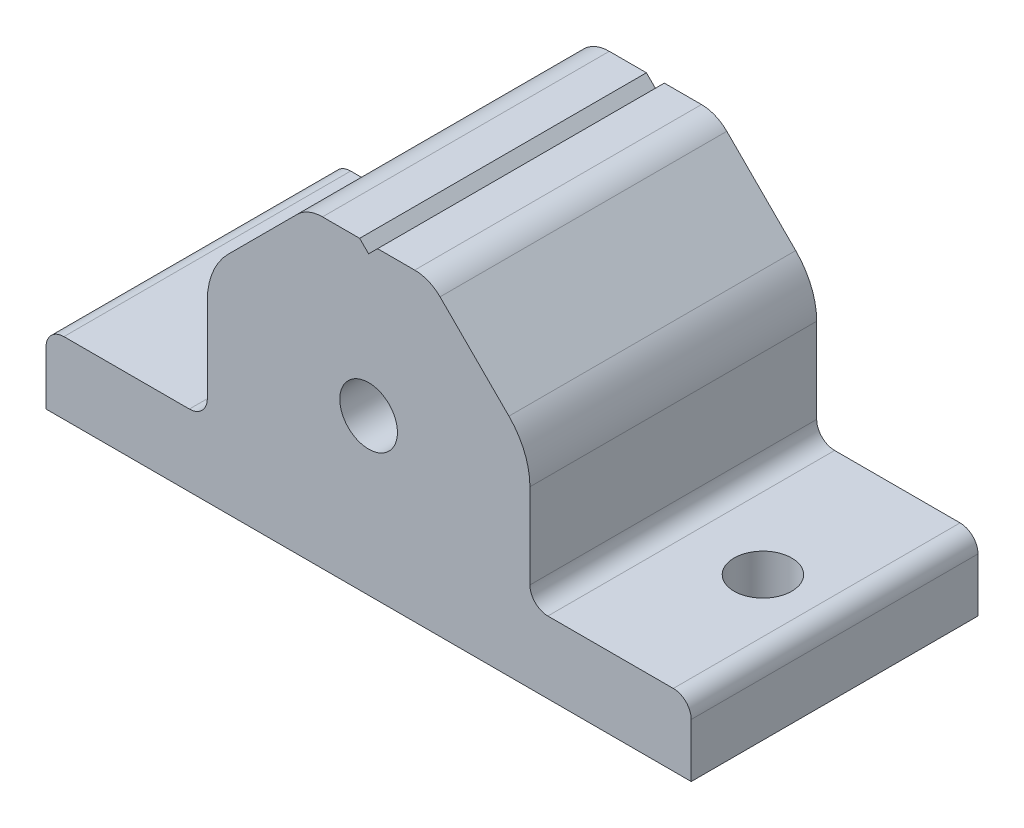
ISO-10303-21;
HEADER;
FILE_DESCRIPTION(('STEP AP214'),'2;1');
FILE_NAME('part.step','',(''),(''),'','','');
FILE_SCHEMA(('AUTOMOTIVE_DESIGN { 1 0 10303 214 1 1 1 1 }'));
ENDSEC;
DATA;
#1=APPLICATION_CONTEXT('core data for automotive mechanical design processes');
#2=APPLICATION_PROTOCOL_DEFINITION('international standard','automotive_design',2000,#1);
#3=PRODUCT_CONTEXT('',#1,'mechanical');
#4=PRODUCT('Part','Part','',(#3));
#5=PRODUCT_RELATED_PRODUCT_CATEGORY('part','',(#4));
#6=PRODUCT_DEFINITION_FORMATION('','',#4);
#7=PRODUCT_DEFINITION_CONTEXT('part definition',#1,'design');
#8=PRODUCT_DEFINITION('design','',#6,#7);
#9=PRODUCT_DEFINITION_SHAPE('','',#8);
#10=(LENGTH_UNIT() NAMED_UNIT(*) SI_UNIT(.MILLI.,.METRE.));
#11=(NAMED_UNIT(*) PLANE_ANGLE_UNIT() SI_UNIT($,.RADIAN.));
#12=(NAMED_UNIT(*) SI_UNIT($,.STERADIAN.) SOLID_ANGLE_UNIT());
#13=UNCERTAINTY_MEASURE_WITH_UNIT(LENGTH_MEASURE(1.E-05),#10,'distance_accuracy_value','');
#14=(GEOMETRIC_REPRESENTATION_CONTEXT(3) GLOBAL_UNCERTAINTY_ASSIGNED_CONTEXT((#13)) GLOBAL_UNIT_ASSIGNED_CONTEXT((#10,
#11,#12)) REPRESENTATION_CONTEXT('',''));
#15=CARTESIAN_POINT('',(0.,0.,0.));
#16=DIRECTION('',(0.,0.,1.));
#17=DIRECTION('',(1.,0.,0.));
#18=AXIS2_PLACEMENT_3D('',#15,#16,#17);
#19=CARTESIAN_POINT('',(0.793749999999984,26.9875,25.4));
#20=DIRECTION('',(-0.707106781186547,0.707106781186548,0.));
#21=DIRECTION('',(-0.707106781186548,-0.707106781186547,0.));
#22=AXIS2_PLACEMENT_3D('',#19,#20,#21);
#23=PLANE('',#22);
#24=DIRECTION('',(-0.707106781186548,-0.707106781186547,0.));
#25=VECTOR('',#24,1.);
#26=CARTESIAN_POINT('',(0.793749999999984,26.9875,25.4));
#27=LINE('',#26,#25);
#28=CARTESIAN_POINT('',(0.,26.19375,25.4));
#29=VERTEX_POINT('',#28);
#30=CARTESIAN_POINT('',(0.793749999999985,26.9875,25.4));
#31=VERTEX_POINT('',#30);
#32=EDGE_CURVE('E272',#29,#31,#27,.F.);
#33=ORIENTED_EDGE('',*,*,#32,.T.);
#34=DIRECTION('',(0.,0.,-1.));
#35=VECTOR('',#34,1.);
#36=CARTESIAN_POINT('',(0.793749999999985,26.9875,25.4));
#37=LINE('',#36,#35);
#38=CARTESIAN_POINT('',(0.793749999999984,26.9875,0.));
#39=VERTEX_POINT('',#38);
#40=EDGE_CURVE('E206',#31,#39,#37,.T.);
#41=ORIENTED_EDGE('',*,*,#40,.T.);
#42=DIRECTION('',(-0.707106781186548,-0.707106781186547,0.));
#43=VECTOR('',#42,1.);
#44=CARTESIAN_POINT('',(0.793749999999984,26.9875,0.));
#45=LINE('',#44,#43);
#46=CARTESIAN_POINT('',(0.,26.19375,0.));
#47=VERTEX_POINT('',#46);
#48=EDGE_CURVE('E279',#39,#47,#45,.T.);
#49=ORIENTED_EDGE('',*,*,#48,.T.);
#50=DIRECTION('',(0.,0.,1.));
#51=VECTOR('',#50,1.);
#52=CARTESIAN_POINT('',(0.,26.19375,25.4));
#53=LINE('',#52,#51);
#54=EDGE_CURVE('E259',#29,#47,#53,.F.);
#55=ORIENTED_EDGE('',*,*,#54,.F.);
#56=EDGE_LOOP('',(#33,#41,#49,#55));
#57=FACE_BOUND('',#56,.T.);
#58=ADVANCED_FACE('F18',(#57),#23,.T.);
#59=CARTESIAN_POINT('',(0.,26.19375,25.4));
#60=DIRECTION('',(0.707106781186547,0.707106781186548,0.));
#61=DIRECTION('',(-0.707106781186548,0.707106781186547,0.));
#62=AXIS2_PLACEMENT_3D('',#59,#60,#61);
#63=PLANE('',#62);
#64=DIRECTION('',(-0.707106781186548,0.707106781186547,0.));
#65=VECTOR('',#64,1.);
#66=CARTESIAN_POINT('',(0.,26.19375,25.4));
#67=LINE('',#66,#65);
#68=CARTESIAN_POINT('',(-0.793750000000016,26.9875,25.4));
#69=VERTEX_POINT('',#68);
#70=EDGE_CURVE('E271',#69,#29,#67,.F.);
#71=ORIENTED_EDGE('',*,*,#70,.T.);
#72=ORIENTED_EDGE('',*,*,#54,.T.);
#73=DIRECTION('',(-0.707106781186548,0.707106781186547,0.));
#74=VECTOR('',#73,1.);
#75=CARTESIAN_POINT('',(0.,26.19375,0.));
#76=LINE('',#75,#74);
#77=CARTESIAN_POINT('',(-0.793750000000016,26.9875,0.));
#78=VERTEX_POINT('',#77);
#79=EDGE_CURVE('E269',#47,#78,#76,.T.);
#80=ORIENTED_EDGE('',*,*,#79,.T.);
#81=DIRECTION('',(0.,0.,-1.));
#82=VECTOR('',#81,1.);
#83=CARTESIAN_POINT('',(-0.793750000000017,26.9875,25.4));
#84=LINE('',#83,#82);
#85=EDGE_CURVE('E198',#78,#69,#84,.F.);
#86=ORIENTED_EDGE('',*,*,#85,.T.);
#87=EDGE_LOOP('',(#71,#72,#80,#86));
#88=FACE_BOUND('',#87,.T.);
#89=ADVANCED_FACE('F486',(#88),#63,.T.);
#90=CARTESIAN_POINT('',(0.,13.7668,0.));
#91=DIRECTION('',(0.,0.,1.));
#92=DIRECTION('',(1.,0.,0.));
#93=AXIS2_PLACEMENT_3D('',#90,#91,#92);
#94=CYLINDRICAL_SURFACE('',#93,2.5527);
#95=CARTESIAN_POINT('',(0.,13.7668,0.));
#96=DIRECTION('',(0.,0.,1.));
#97=DIRECTION('',(1.,0.,0.));
#98=AXIS2_PLACEMENT_3D('',#95,#96,#97);
#99=CIRCLE('',#98,2.5527);
#100=CARTESIAN_POINT('',(2.55269999999999,13.7668,0.));
#101=VERTEX_POINT('',#100);
#102=EDGE_CURVE('E229',#101,#101,#99,.F.);
#103=ORIENTED_EDGE('',*,*,#102,.T.);
#104=EDGE_LOOP('',(#103));
#105=FACE_BOUND('',#104,.T.);
#106=CARTESIAN_POINT('',(0.,13.7668,25.4));
#107=DIRECTION('',(0.,0.,1.));
#108=DIRECTION('',(1.,0.,0.));
#109=AXIS2_PLACEMENT_3D('',#106,#107,#108);
#110=CIRCLE('',#109,2.5527);
#111=CARTESIAN_POINT('',(2.55269999999999,13.7668,25.4));
#112=VERTEX_POINT('',#111);
#113=EDGE_CURVE('E192',#112,#112,#110,.F.);
#114=ORIENTED_EDGE('',*,*,#113,.F.);
#115=EDGE_LOOP('',(#114));
#116=FACE_BOUND('',#115,.T.);
#117=ADVANCED_FACE('F523',(#105,#116),#94,.F.);
#118=CARTESIAN_POINT('',(-7.93749999999999,15.4672438789308,0.));
#119=DIRECTION('',(0.,0.,-1.));
#120=DIRECTION('',(-1.,0.,0.));
#121=AXIS2_PLACEMENT_3D('',#118,#119,#120);
#122=CYLINDRICAL_SURFACE('',#121,6.35);
#123=CARTESIAN_POINT('',(-7.93749999999999,15.4672438789308,0.));
#124=DIRECTION('',(0.,0.,-1.));
#125=DIRECTION('',(-1.,0.,0.));
#126=AXIS2_PLACEMENT_3D('',#123,#124,#125);
#127=CIRCLE('',#126,6.35);
#128=CARTESIAN_POINT('',(-12.4276280605346,19.9573719394654,0.));
#129=VERTEX_POINT('',#128);
#130=CARTESIAN_POINT('',(-14.2875,15.4672438789308,0.));
#131=VERTEX_POINT('',#130);
#132=EDGE_CURVE('E322',#129,#131,#127,.F.);
#133=ORIENTED_EDGE('',*,*,#132,.T.);
#134=DIRECTION('',(0.,0.,1.));
#135=VECTOR('',#134,1.);
#136=CARTESIAN_POINT('',(-14.2875,15.4672438789308,0.));
#137=LINE('',#136,#135);
#138=CARTESIAN_POINT('',(-14.2875,15.4672438789308,25.4));
#139=VERTEX_POINT('',#138);
#140=EDGE_CURVE('E256',#131,#139,#137,.T.);
#141=ORIENTED_EDGE('',*,*,#140,.T.);
#142=CARTESIAN_POINT('',(-7.93749999999999,15.4672438789308,25.4));
#143=DIRECTION('',(0.,0.,-1.));
#144=DIRECTION('',(-1.,0.,0.));
#145=AXIS2_PLACEMENT_3D('',#142,#143,#144);
#146=CIRCLE('',#145,6.35);
#147=CARTESIAN_POINT('',(-12.4276280605346,19.9573719394654,25.4));
#148=VERTEX_POINT('',#147);
#149=EDGE_CURVE('E184',#148,#139,#146,.F.);
#150=ORIENTED_EDGE('',*,*,#149,.F.);
#151=DIRECTION('',(0.,0.,1.));
#152=VECTOR('',#151,1.);
#153=CARTESIAN_POINT('',(-12.4276280605346,19.9573719394654,25.4));
#154=LINE('',#153,#152);
#155=EDGE_CURVE('E180',#148,#129,#154,.F.);
#156=ORIENTED_EDGE('',*,*,#155,.T.);
#157=EDGE_LOOP('',(#133,#141,#150,#156));
#158=FACE_BOUND('',#157,.T.);
#159=ADVANCED_FACE('F427',(#158),#122,.T.);
#160=CARTESIAN_POINT('',(-14.2875,26.9875,0.));
#161=DIRECTION('',(1.,0.,0.));
#162=DIRECTION('',(0.,1.,0.));
#163=AXIS2_PLACEMENT_3D('',#160,#161,#162);
#164=PLANE('',#163);
#165=ORIENTED_EDGE('',*,*,#140,.F.);
#166=DIRECTION('',(0.,1.,0.));
#167=VECTOR('',#166,1.);
#168=CARTESIAN_POINT('',(-14.2875,0.,0.));
#169=LINE('',#168,#167);
#170=CARTESIAN_POINT('',(-14.2875,7.9375,0.));
#171=VERTEX_POINT('',#170);
#172=EDGE_CURVE('E321',#131,#171,#169,.F.);
#173=ORIENTED_EDGE('',*,*,#172,.T.);
#174=DIRECTION('',(0.,0.,-1.));
#175=VECTOR('',#174,1.);
#176=CARTESIAN_POINT('',(-14.2875,7.9375,0.));
#177=LINE('',#176,#175);
#178=CARTESIAN_POINT('',(-14.2875,7.9375,25.4));
#179=VERTEX_POINT('',#178);
#180=EDGE_CURVE('E253',#171,#179,#177,.F.);
#181=ORIENTED_EDGE('',*,*,#180,.T.);
#182=DIRECTION('',(0.,1.,0.));
#183=VECTOR('',#182,1.);
#184=CARTESIAN_POINT('',(-14.2875,0.,25.4));
#185=LINE('',#184,#183);
#186=EDGE_CURVE('E186',#139,#179,#185,.F.);
#187=ORIENTED_EDGE('',*,*,#186,.F.);
#188=EDGE_LOOP('',(#165,#173,#181,#187));
#189=FACE_BOUND('',#188,.T.);
#190=ADVANCED_FACE('F425',(#189),#164,.F.);
#191=CARTESIAN_POINT('',(-15.875,7.9375,0.));
#192=DIRECTION('',(0.,0.,-1.));
#193=DIRECTION('',(-1.,0.,0.));
#194=AXIS2_PLACEMENT_3D('',#191,#192,#193);
#195=CYLINDRICAL_SURFACE('',#194,1.5875);
#196=DIRECTION('',(0.,0.,1.));
#197=VECTOR('',#196,1.);
#198=CARTESIAN_POINT('',(-15.875,6.35,0.));
#199=LINE('',#198,#197);
#200=CARTESIAN_POINT('',(-15.875,6.35,0.));
#201=VERTEX_POINT('',#200);
#202=CARTESIAN_POINT('',(-15.875,6.35,25.4));
#203=VERTEX_POINT('',#202);
#204=EDGE_CURVE('E250',#201,#203,#199,.T.);
#205=ORIENTED_EDGE('',*,*,#204,.T.);
#206=CARTESIAN_POINT('',(-15.875,7.9375,25.4));
#207=DIRECTION('',(0.,0.,-1.));
#208=DIRECTION('',(-1.,0.,0.));
#209=AXIS2_PLACEMENT_3D('',#206,#207,#208);
#210=CIRCLE('',#209,1.5875);
#211=EDGE_CURVE('E342',#179,#203,#210,.T.);
#212=ORIENTED_EDGE('',*,*,#211,.F.);
#213=ORIENTED_EDGE('',*,*,#180,.F.);
#214=CARTESIAN_POINT('',(-15.875,7.9375,0.));
#215=DIRECTION('',(0.,0.,-1.));
#216=DIRECTION('',(-1.,0.,0.));
#217=AXIS2_PLACEMENT_3D('',#214,#215,#216);
#218=CIRCLE('',#217,1.5875);
#219=EDGE_CURVE('E318',#171,#201,#218,.T.);
#220=ORIENTED_EDGE('',*,*,#219,.T.);
#221=EDGE_LOOP('',(#205,#212,#213,#220));
#222=FACE_BOUND('',#221,.T.);
#223=ADVANCED_FACE('F422',(#222),#195,.F.);
#224=CARTESIAN_POINT('',(-28.575,6.35,0.));
#225=DIRECTION('',(0.,-1.,0.));
#226=DIRECTION('',(1.,0.,0.));
#227=AXIS2_PLACEMENT_3D('',#224,#225,#226);
#228=PLANE('',#227);
#229=DIRECTION('',(0.,0.,1.));
#230=VECTOR('',#229,1.);
#231=CARTESIAN_POINT('',(-26.9875,6.35,0.));
#232=LINE('',#231,#230);
#233=CARTESIAN_POINT('',(-26.9875,6.35,25.4));
#234=VERTEX_POINT('',#233);
#235=CARTESIAN_POINT('',(-26.9875,6.35,0.));
#236=VERTEX_POINT('',#235);
#237=EDGE_CURVE('E227',#234,#236,#232,.F.);
#238=ORIENTED_EDGE('',*,*,#237,.F.);
#239=DIRECTION('',(1.,0.,0.));
#240=VECTOR('',#239,1.);
#241=CARTESIAN_POINT('',(0.,6.35,25.4));
#242=LINE('',#241,#240);
#243=EDGE_CURVE('E341',#203,#234,#242,.F.);
#244=ORIENTED_EDGE('',*,*,#243,.F.);
#245=ORIENTED_EDGE('',*,*,#204,.F.);
#246=DIRECTION('',(1.,0.,0.));
#247=VECTOR('',#246,1.);
#248=CARTESIAN_POINT('',(0.,6.35,0.));
#249=LINE('',#248,#247);
#250=EDGE_CURVE('E317',#201,#236,#249,.F.);
#251=ORIENTED_EDGE('',*,*,#250,.T.);
#252=EDGE_LOOP('',(#238,#244,#245,#251));
#253=FACE_BOUND('',#252,.T.);
#254=CARTESIAN_POINT('',(-22.225,6.34999999999999,12.7));
#255=DIRECTION('',(0.,1.,0.));
#256=DIRECTION('',(-1.,0.,0.));
#257=AXIS2_PLACEMENT_3D('',#254,#255,#256);
#258=CIRCLE('',#257,2.5527);
#259=CARTESIAN_POINT('',(-24.7777,6.34999999999999,12.7));
#260=VERTEX_POINT('',#259);
#261=EDGE_CURVE('E21',#260,#260,#258,.F.);
#262=ORIENTED_EDGE('',*,*,#261,.T.);
#263=EDGE_LOOP('',(#262));
#264=FACE_BOUND('',#263,.T.);
#265=ADVANCED_FACE('F351',(#253,#264),#228,.F.);
#266=CARTESIAN_POINT('',(-26.9875,4.7625,0.));
#267=DIRECTION('',(0.,0.,1.));
#268=DIRECTION('',(1.,0.,0.));
#269=AXIS2_PLACEMENT_3D('',#266,#267,#268);
#270=CYLINDRICAL_SURFACE('',#269,1.5875);
#271=CARTESIAN_POINT('',(-26.9875,4.7625,25.4));
#272=DIRECTION('',(0.,0.,1.));
#273=DIRECTION('',(1.,0.,0.));
#274=AXIS2_PLACEMENT_3D('',#271,#272,#273);
#275=CIRCLE('',#274,1.5875);
#276=CARTESIAN_POINT('',(-28.575,4.7625,25.4));
#277=VERTEX_POINT('',#276);
#278=EDGE_CURVE('E339',#234,#277,#275,.T.);
#279=ORIENTED_EDGE('',*,*,#278,.F.);
#280=ORIENTED_EDGE('',*,*,#237,.T.);
#281=CARTESIAN_POINT('',(-26.9875,4.7625,0.));
#282=DIRECTION('',(0.,0.,1.));
#283=DIRECTION('',(1.,0.,0.));
#284=AXIS2_PLACEMENT_3D('',#281,#282,#283);
#285=CIRCLE('',#284,1.5875);
#286=CARTESIAN_POINT('',(-28.575,4.7625,0.));
#287=VERTEX_POINT('',#286);
#288=EDGE_CURVE('E313',#236,#287,#285,.T.);
#289=ORIENTED_EDGE('',*,*,#288,.T.);
#290=DIRECTION('',(0.,0.,1.));
#291=VECTOR('',#290,1.);
#292=CARTESIAN_POINT('',(-28.575,4.7625,25.4));
#293=LINE('',#292,#291);
#294=EDGE_CURVE('E239',#287,#277,#293,.T.);
#295=ORIENTED_EDGE('',*,*,#294,.T.);
#296=EDGE_LOOP('',(#279,#280,#289,#295));
#297=FACE_BOUND('',#296,.T.);
#298=ADVANCED_FACE('F399',(#297),#270,.T.);
#299=CARTESIAN_POINT('',(26.9875,4.7625,25.4));
#300=DIRECTION('',(0.,0.,1.));
#301=DIRECTION('',(1.,0.,0.));
#302=AXIS2_PLACEMENT_3D('',#299,#300,#301);
#303=CYLINDRICAL_SURFACE('',#302,1.5875);
#304=CARTESIAN_POINT('',(26.9875,4.7625,25.4));
#305=DIRECTION('',(0.,0.,1.));
#306=DIRECTION('',(1.,0.,0.));
#307=AXIS2_PLACEMENT_3D('',#304,#305,#306);
#308=CIRCLE('',#307,1.5875);
#309=CARTESIAN_POINT('',(28.575,4.7625,25.4));
#310=VERTEX_POINT('',#309);
#311=CARTESIAN_POINT('',(26.9875,6.35,25.4));
#312=VERTEX_POINT('',#311);
#313=EDGE_CURVE('E336',#310,#312,#308,.T.);
#314=ORIENTED_EDGE('',*,*,#313,.F.);
#315=DIRECTION('',(0.,0.,1.));
#316=VECTOR('',#315,1.);
#317=CARTESIAN_POINT('',(28.575,4.7625,25.4));
#318=LINE('',#317,#316);
#319=CARTESIAN_POINT('',(28.575,4.7625,0.));
#320=VERTEX_POINT('',#319);
#321=EDGE_CURVE('E228',#310,#320,#318,.F.);
#322=ORIENTED_EDGE('',*,*,#321,.T.);
#323=CARTESIAN_POINT('',(26.9875,4.7625,0.));
#324=DIRECTION('',(0.,0.,1.));
#325=DIRECTION('',(1.,0.,0.));
#326=AXIS2_PLACEMENT_3D('',#323,#324,#325);
#327=CIRCLE('',#326,1.5875);
#328=CARTESIAN_POINT('',(26.9875,6.35,0.));
#329=VERTEX_POINT('',#328);
#330=EDGE_CURVE('E310',#320,#329,#327,.T.);
#331=ORIENTED_EDGE('',*,*,#330,.T.);
#332=DIRECTION('',(0.,0.,1.));
#333=VECTOR('',#332,1.);
#334=CARTESIAN_POINT('',(26.9875,6.35,0.));
#335=LINE('',#334,#333);
#336=EDGE_CURVE('E224',#329,#312,#335,.T.);
#337=ORIENTED_EDGE('',*,*,#336,.T.);
#338=EDGE_LOOP('',(#314,#322,#331,#337));
#339=FACE_BOUND('',#338,.T.);
#340=ADVANCED_FACE('F451',(#339),#303,.T.);
#341=CARTESIAN_POINT('',(28.575,6.35,0.));
#342=DIRECTION('',(0.,-1.,0.));
#343=DIRECTION('',(1.,0.,0.));
#344=AXIS2_PLACEMENT_3D('',#341,#342,#343);
#345=PLANE('',#344);
#346=ORIENTED_EDGE('',*,*,#336,.F.);
#347=DIRECTION('',(1.,0.,0.));
#348=VECTOR('',#347,1.);
#349=CARTESIAN_POINT('',(0.,6.35,0.));
#350=LINE('',#349,#348);
#351=CARTESIAN_POINT('',(15.875,6.35,0.));
#352=VERTEX_POINT('',#351);
#353=EDGE_CURVE('E309',#329,#352,#350,.F.);
#354=ORIENTED_EDGE('',*,*,#353,.T.);
#355=DIRECTION('',(0.,0.,-1.));
#356=VECTOR('',#355,1.);
#357=CARTESIAN_POINT('',(15.875,6.35,0.));
#358=LINE('',#357,#356);
#359=CARTESIAN_POINT('',(15.875,6.35,25.4));
#360=VERTEX_POINT('',#359);
#361=EDGE_CURVE('E221',#352,#360,#358,.F.);
#362=ORIENTED_EDGE('',*,*,#361,.T.);
#363=DIRECTION('',(1.,0.,0.));
#364=VECTOR('',#363,1.);
#365=CARTESIAN_POINT('',(0.,6.35,25.4));
#366=LINE('',#365,#364);
#367=EDGE_CURVE('E335',#312,#360,#366,.F.);
#368=ORIENTED_EDGE('',*,*,#367,.F.);
#369=EDGE_LOOP('',(#346,#354,#362,#368));
#370=FACE_BOUND('',#369,.T.);
#371=CARTESIAN_POINT('',(22.225,6.35,12.7));
#372=DIRECTION('',(0.,1.,0.));
#373=DIRECTION('',(-1.,0.,0.));
#374=AXIS2_PLACEMENT_3D('',#371,#372,#373);
#375=CIRCLE('',#374,2.5527);
#376=CARTESIAN_POINT('',(19.6723,6.35,12.7));
#377=VERTEX_POINT('',#376);
#378=EDGE_CURVE('E242',#377,#377,#375,.F.);
#379=ORIENTED_EDGE('',*,*,#378,.T.);
#380=EDGE_LOOP('',(#379));
#381=FACE_BOUND('',#380,.T.);
#382=ADVANCED_FACE('F454',(#370,#381),#345,.F.);
#383=CARTESIAN_POINT('',(15.875,7.9375,0.));
#384=DIRECTION('',(0.,0.,-1.));
#385=DIRECTION('',(-1.,0.,0.));
#386=AXIS2_PLACEMENT_3D('',#383,#384,#385);
#387=CYLINDRICAL_SURFACE('',#386,1.5875);
#388=DIRECTION('',(0.,0.,1.));
#389=VECTOR('',#388,1.);
#390=CARTESIAN_POINT('',(14.2875,7.9375,0.));
#391=LINE('',#390,#389);
#392=CARTESIAN_POINT('',(14.2875,7.9375,0.));
#393=VERTEX_POINT('',#392);
#394=CARTESIAN_POINT('',(14.2875,7.9375,25.4));
#395=VERTEX_POINT('',#394);
#396=EDGE_CURVE('E218',#393,#395,#391,.T.);
#397=ORIENTED_EDGE('',*,*,#396,.T.);
#398=CARTESIAN_POINT('',(15.875,7.9375,25.4));
#399=DIRECTION('',(0.,0.,-1.));
#400=DIRECTION('',(-1.,0.,0.));
#401=AXIS2_PLACEMENT_3D('',#398,#399,#400);
#402=CIRCLE('',#401,1.5875);
#403=EDGE_CURVE('E333',#360,#395,#402,.T.);
#404=ORIENTED_EDGE('',*,*,#403,.F.);
#405=ORIENTED_EDGE('',*,*,#361,.F.);
#406=CARTESIAN_POINT('',(15.875,7.9375,0.));
#407=DIRECTION('',(0.,0.,-1.));
#408=DIRECTION('',(-1.,0.,0.));
#409=AXIS2_PLACEMENT_3D('',#406,#407,#408);
#410=CIRCLE('',#409,1.5875);
#411=EDGE_CURVE('E306',#352,#393,#410,.T.);
#412=ORIENTED_EDGE('',*,*,#411,.T.);
#413=EDGE_LOOP('',(#397,#404,#405,#412));
#414=FACE_BOUND('',#413,.T.);
#415=ADVANCED_FACE('F458',(#414),#387,.F.);
#416=CARTESIAN_POINT('',(14.2875,26.9875,0.));
#417=DIRECTION('',(-1.,0.,0.));
#418=DIRECTION('',(0.,-1.,0.));
#419=AXIS2_PLACEMENT_3D('',#416,#417,#418);
#420=PLANE('',#419);
#421=DIRECTION('',(0.,0.,1.));
#422=VECTOR('',#421,1.);
#423=CARTESIAN_POINT('',(14.2875,15.4672438789308,0.));
#424=LINE('',#423,#422);
#425=CARTESIAN_POINT('',(14.2875,15.4672438789308,25.4));
#426=VERTEX_POINT('',#425);
#427=CARTESIAN_POINT('',(14.2875,15.4672438789308,0.));
#428=VERTEX_POINT('',#427);
#429=EDGE_CURVE('E216',#426,#428,#424,.F.);
#430=ORIENTED_EDGE('',*,*,#429,.F.);
#431=DIRECTION('',(0.,1.,0.));
#432=VECTOR('',#431,1.);
#433=CARTESIAN_POINT('',(14.2875,0.,25.4));
#434=LINE('',#433,#432);
#435=EDGE_CURVE('E332',#395,#426,#434,.T.);
#436=ORIENTED_EDGE('',*,*,#435,.F.);
#437=ORIENTED_EDGE('',*,*,#396,.F.);
#438=DIRECTION('',(0.,1.,0.));
#439=VECTOR('',#438,1.);
#440=CARTESIAN_POINT('',(14.2875,0.,0.));
#441=LINE('',#440,#439);
#442=EDGE_CURVE('E305',#393,#428,#441,.T.);
#443=ORIENTED_EDGE('',*,*,#442,.T.);
#444=EDGE_LOOP('',(#430,#436,#437,#443));
#445=FACE_BOUND('',#444,.T.);
#446=ADVANCED_FACE('F463',(#445),#420,.F.);
#447=CARTESIAN_POINT('',(7.9375,15.4672438789308,0.));
#448=DIRECTION('',(0.,0.,1.));
#449=DIRECTION('',(1.,0.,0.));
#450=AXIS2_PLACEMENT_3D('',#447,#448,#449);
#451=CYLINDRICAL_SURFACE('',#450,6.35);
#452=CARTESIAN_POINT('',(7.9375,15.4672438789308,25.4));
#453=DIRECTION('',(0.,0.,1.));
#454=DIRECTION('',(1.,0.,0.));
#455=AXIS2_PLACEMENT_3D('',#452,#453,#454);
#456=CIRCLE('',#455,6.35);
#457=CARTESIAN_POINT('',(12.4276280605346,19.9573719394654,25.4));
#458=VERTEX_POINT('',#457);
#459=EDGE_CURVE('E330',#426,#458,#456,.T.);
#460=ORIENTED_EDGE('',*,*,#459,.F.);
#461=ORIENTED_EDGE('',*,*,#429,.T.);
#462=CARTESIAN_POINT('',(7.9375,15.4672438789308,0.));
#463=DIRECTION('',(0.,0.,1.));
#464=DIRECTION('',(1.,0.,0.));
#465=AXIS2_PLACEMENT_3D('',#462,#463,#464);
#466=CIRCLE('',#465,6.35);
#467=CARTESIAN_POINT('',(12.4276280605346,19.9573719394654,0.));
#468=VERTEX_POINT('',#467);
#469=EDGE_CURVE('E302',#428,#468,#466,.T.);
#470=ORIENTED_EDGE('',*,*,#469,.T.);
#471=DIRECTION('',(0.,0.,1.));
#472=VECTOR('',#471,1.);
#473=CARTESIAN_POINT('',(12.4276280605346,19.9573719394654,0.));
#474=LINE('',#473,#472);
#475=EDGE_CURVE('E213',#468,#458,#474,.T.);
#476=ORIENTED_EDGE('',*,*,#475,.T.);
#477=EDGE_LOOP('',(#460,#461,#470,#476));
#478=FACE_BOUND('',#477,.T.);
#479=ADVANCED_FACE('F467',(#478),#451,.T.);
#480=CARTESIAN_POINT('',(14.2875,18.0975,0.));
#481=DIRECTION('',(-0.707106781186546,-0.707106781186549,0.));
#482=DIRECTION('',(0.707106781186549,-0.707106781186546,0.));
#483=AXIS2_PLACEMENT_3D('',#480,#481,#482);
#484=PLANE('',#483);
#485=DIRECTION('',(0.,0.,-1.));
#486=VECTOR('',#485,1.);
#487=CARTESIAN_POINT('',(6.32743596973268,26.0575640302673,25.4));
#488=LINE('',#487,#486);
#489=CARTESIAN_POINT('',(6.32743596973268,26.0575640302673,25.4));
#490=VERTEX_POINT('',#489);
#491=CARTESIAN_POINT('',(6.32743596973268,26.0575640302673,0.));
#492=VERTEX_POINT('',#491);
#493=EDGE_CURVE('E209',#490,#492,#488,.T.);
#494=ORIENTED_EDGE('',*,*,#493,.F.);
#495=DIRECTION('',(-0.707106781186549,0.707106781186547,0.));
#496=VECTOR('',#495,1.);
#497=CARTESIAN_POINT('',(12.4276280605346,19.9573719394654,25.4));
#498=LINE('',#497,#496);
#499=EDGE_CURVE('E329',#458,#490,#498,.T.);
#500=ORIENTED_EDGE('',*,*,#499,.F.);
#501=ORIENTED_EDGE('',*,*,#475,.F.);
#502=DIRECTION('',(-0.707106781186549,0.707106781186547,0.));
#503=VECTOR('',#502,1.);
#504=CARTESIAN_POINT('',(12.4276280605346,19.9573719394654,0.));
#505=LINE('',#504,#503);
#506=EDGE_CURVE('E301',#468,#492,#505,.T.);
#507=ORIENTED_EDGE('',*,*,#506,.T.);
#508=EDGE_LOOP('',(#494,#500,#501,#507));
#509=FACE_BOUND('',#508,.T.);
#510=ADVANCED_FACE('F472',(#509),#484,.F.);
#511=CARTESIAN_POINT('',(4.0823719394654,23.8125,25.4));
#512=DIRECTION('',(0.,0.,-1.));
#513=DIRECTION('',(-1.,0.,0.));
#514=AXIS2_PLACEMENT_3D('',#511,#512,#513);
#515=CYLINDRICAL_SURFACE('',#514,3.175);
#516=CARTESIAN_POINT('',(4.0823719394654,23.8125,0.));
#517=DIRECTION('',(0.,0.,-1.));
#518=DIRECTION('',(-1.,0.,0.));
#519=AXIS2_PLACEMENT_3D('',#516,#517,#518);
#520=CIRCLE('',#519,3.175);
#521=CARTESIAN_POINT('',(4.08237193946539,26.9875,0.));
#522=VERTEX_POINT('',#521);
#523=EDGE_CURVE('E297',#492,#522,#520,.F.);
#524=ORIENTED_EDGE('',*,*,#523,.T.);
#525=DIRECTION('',(0.,0.,-1.));
#526=VECTOR('',#525,1.);
#527=CARTESIAN_POINT('',(4.08237193946539,26.9875,25.4));
#528=LINE('',#527,#526);
#529=CARTESIAN_POINT('',(4.08237193946539,26.9875,25.4));
#530=VERTEX_POINT('',#529);
#531=EDGE_CURVE('E201',#522,#530,#528,.F.);
#532=ORIENTED_EDGE('',*,*,#531,.T.);
#533=CARTESIAN_POINT('',(4.0823719394654,23.8125,25.4));
#534=DIRECTION('',(0.,0.,-1.));
#535=DIRECTION('',(-1.,0.,0.));
#536=AXIS2_PLACEMENT_3D('',#533,#534,#535);
#537=CIRCLE('',#536,3.175);
#538=EDGE_CURVE('E327',#490,#530,#537,.F.);
#539=ORIENTED_EDGE('',*,*,#538,.F.);
#540=ORIENTED_EDGE('',*,*,#493,.T.);
#541=EDGE_LOOP('',(#524,#532,#539,#540));
#542=FACE_BOUND('',#541,.T.);
#543=ADVANCED_FACE('F476',(#542),#515,.T.);
#544=CARTESIAN_POINT('',(-28.575,26.9875,25.4));
#545=DIRECTION('',(0.,-1.,0.));
#546=DIRECTION('',(0.,0.,-1.));
#547=AXIS2_PLACEMENT_3D('',#544,#545,#546);
#548=PLANE('',#547);
#549=ORIENTED_EDGE('',*,*,#531,.F.);
#550=DIRECTION('',(1.,0.,0.));
#551=VECTOR('',#550,1.);
#552=CARTESIAN_POINT('',(0.,26.9875,0.));
#553=LINE('',#552,#551);
#554=EDGE_CURVE('E300',#522,#39,#553,.F.);
#555=ORIENTED_EDGE('',*,*,#554,.T.);
#556=ORIENTED_EDGE('',*,*,#40,.F.);
#557=DIRECTION('',(1.,0.,0.));
#558=VECTOR('',#557,1.);
#559=CARTESIAN_POINT('',(0.,26.9875,25.4));
#560=LINE('',#559,#558);
#561=EDGE_CURVE('E262',#530,#31,#560,.F.);
#562=ORIENTED_EDGE('',*,*,#561,.F.);
#563=EDGE_LOOP('',(#549,#555,#556,#562));
#564=FACE_BOUND('',#563,.T.);
#565=ADVANCED_FACE('F481',(#564),#548,.F.);
#566=CARTESIAN_POINT('',(-28.575,26.9875,25.4));
#567=DIRECTION('',(0.,-1.,0.));
#568=DIRECTION('',(0.,0.,-1.));
#569=AXIS2_PLACEMENT_3D('',#566,#567,#568);
#570=PLANE('',#569);
#571=DIRECTION('',(0.,0.,1.));
#572=VECTOR('',#571,1.);
#573=CARTESIAN_POINT('',(-4.0823719394654,26.9875,25.4));
#574=LINE('',#573,#572);
#575=CARTESIAN_POINT('',(-4.0823719394654,26.9875,25.4));
#576=VERTEX_POINT('',#575);
#577=CARTESIAN_POINT('',(-4.0823719394654,26.9875,0.));
#578=VERTEX_POINT('',#577);
#579=EDGE_CURVE('E196',#576,#578,#574,.F.);
#580=ORIENTED_EDGE('',*,*,#579,.F.);
#581=DIRECTION('',(1.,0.,0.));
#582=VECTOR('',#581,1.);
#583=CARTESIAN_POINT('',(0.,26.9875,25.4));
#584=LINE('',#583,#582);
#585=EDGE_CURVE('E158',#69,#576,#584,.F.);
#586=ORIENTED_EDGE('',*,*,#585,.F.);
#587=ORIENTED_EDGE('',*,*,#85,.F.);
#588=DIRECTION('',(1.,0.,0.));
#589=VECTOR('',#588,1.);
#590=CARTESIAN_POINT('',(0.,26.9875,0.));
#591=LINE('',#590,#589);
#592=EDGE_CURVE('E296',#78,#578,#591,.F.);
#593=ORIENTED_EDGE('',*,*,#592,.T.);
#594=EDGE_LOOP('',(#580,#586,#587,#593));
#595=FACE_BOUND('',#594,.T.);
#596=ADVANCED_FACE('F489',(#595),#570,.F.);
#597=CARTESIAN_POINT('',(-4.0823719394654,23.8125,25.4));
#598=DIRECTION('',(0.,0.,1.));
#599=DIRECTION('',(1.,0.,0.));
#600=AXIS2_PLACEMENT_3D('',#597,#598,#599);
#601=CYLINDRICAL_SURFACE('',#600,3.175);
#602=CARTESIAN_POINT('',(-4.0823719394654,23.8125,25.4));
#603=DIRECTION('',(0.,0.,1.));
#604=DIRECTION('',(1.,0.,0.));
#605=AXIS2_PLACEMENT_3D('',#602,#603,#604);
#606=CIRCLE('',#605,3.175);
#607=CARTESIAN_POINT('',(-6.32743596973269,26.0575640302673,25.4));
#608=VERTEX_POINT('',#607);
#609=EDGE_CURVE('E162',#576,#608,#606,.T.);
#610=ORIENTED_EDGE('',*,*,#609,.F.);
#611=ORIENTED_EDGE('',*,*,#579,.T.);
#612=CARTESIAN_POINT('',(-4.0823719394654,23.8125,0.));
#613=DIRECTION('',(0.,0.,1.));
#614=DIRECTION('',(1.,0.,0.));
#615=AXIS2_PLACEMENT_3D('',#612,#613,#614);
#616=CIRCLE('',#615,3.175);
#617=CARTESIAN_POINT('',(-6.3274359697327,26.0575640302673,0.));
#618=VERTEX_POINT('',#617);
#619=EDGE_CURVE('E176',#578,#618,#616,.T.);
#620=ORIENTED_EDGE('',*,*,#619,.T.);
#621=DIRECTION('',(0.,0.,1.));
#622=VECTOR('',#621,1.);
#623=CARTESIAN_POINT('',(-6.3274359697327,26.0575640302673,25.4));
#624=LINE('',#623,#622);
#625=EDGE_CURVE('E173',#618,#608,#624,.T.);
#626=ORIENTED_EDGE('',*,*,#625,.T.);
#627=EDGE_LOOP('',(#610,#611,#620,#626));
#628=FACE_BOUND('',#627,.T.);
#629=ADVANCED_FACE('F174',(#628),#601,.T.);
#630=CARTESIAN_POINT('',(-5.39749999999999,26.9875,25.4));
#631=DIRECTION('',(0.707106781186549,-0.707106781186546,0.));
#632=DIRECTION('',(0.707106781186546,0.707106781186549,0.));
#633=AXIS2_PLACEMENT_3D('',#630,#631,#632);
#634=PLANE('',#633);
#635=ORIENTED_EDGE('',*,*,#625,.F.);
#636=DIRECTION('',(-0.707106781186546,-0.707106781186548,0.));
#637=VECTOR('',#636,1.);
#638=CARTESIAN_POINT('',(-6.3274359697327,26.0575640302673,0.));
#639=LINE('',#638,#637);
#640=EDGE_CURVE('E294',#618,#129,#639,.T.);
#641=ORIENTED_EDGE('',*,*,#640,.T.);
#642=ORIENTED_EDGE('',*,*,#155,.F.);
#643=DIRECTION('',(-0.707106781186547,-0.707106781186548,0.));
#644=VECTOR('',#643,1.);
#645=CARTESIAN_POINT('',(-6.3274359697327,26.0575640302673,25.4));
#646=LINE('',#645,#644);
#647=EDGE_CURVE('E168',#608,#148,#646,.T.);
#648=ORIENTED_EDGE('',*,*,#647,.F.);
#649=EDGE_LOOP('',(#635,#641,#642,#648));
#650=FACE_BOUND('',#649,.T.);
#651=ADVANCED_FACE('F182',(#650),#634,.F.);
#652=CARTESIAN_POINT('',(-22.225,0.,12.7));
#653=DIRECTION('',(0.,1.,0.));
#654=DIRECTION('',(-1.,0.,0.));
#655=AXIS2_PLACEMENT_3D('',#652,#653,#654);
#656=CYLINDRICAL_SURFACE('',#655,2.5527);
#657=CARTESIAN_POINT('',(-22.225,0.,12.7));
#658=DIRECTION('',(0.,1.,0.));
#659=DIRECTION('',(-1.,0.,0.));
#660=AXIS2_PLACEMENT_3D('',#657,#658,#659);
#661=CIRCLE('',#660,2.5527);
#662=CARTESIAN_POINT('',(-24.7777,0.,12.7));
#663=VERTEX_POINT('',#662);
#664=EDGE_CURVE('E291',#663,#663,#661,.F.);
#665=ORIENTED_EDGE('',*,*,#664,.T.);
#666=EDGE_LOOP('',(#665));
#667=FACE_BOUND('',#666,.T.);
#668=ORIENTED_EDGE('',*,*,#261,.F.);
#669=EDGE_LOOP('',(#668));
#670=FACE_BOUND('',#669,.T.);
#671=ADVANCED_FACE('F353',(#667,#670),#656,.F.);
#672=CARTESIAN_POINT('',(22.225,0.,12.7));
#673=DIRECTION('',(0.,1.,0.));
#674=DIRECTION('',(-1.,0.,0.));
#675=AXIS2_PLACEMENT_3D('',#672,#673,#674);
#676=CYLINDRICAL_SURFACE('',#675,2.5527);
#677=CARTESIAN_POINT('',(22.225,0.,12.7));
#678=DIRECTION('',(0.,1.,0.));
#679=DIRECTION('',(-1.,0.,0.));
#680=AXIS2_PLACEMENT_3D('',#677,#678,#679);
#681=CIRCLE('',#680,2.5527);
#682=CARTESIAN_POINT('',(19.6723,0.,12.7));
#683=VERTEX_POINT('',#682);
#684=EDGE_CURVE('E246',#683,#683,#681,.F.);
#685=ORIENTED_EDGE('',*,*,#684,.T.);
#686=EDGE_LOOP('',(#685));
#687=FACE_BOUND('',#686,.T.);
#688=ORIENTED_EDGE('',*,*,#378,.F.);
#689=EDGE_LOOP('',(#688));
#690=FACE_BOUND('',#689,.T.);
#691=ADVANCED_FACE('F355',(#687,#690),#676,.F.);
#692=CARTESIAN_POINT('',(-28.575,26.9875,25.4));
#693=DIRECTION('',(1.,0.,0.));
#694=DIRECTION('',(0.,1.,0.));
#695=AXIS2_PLACEMENT_3D('',#692,#693,#694);
#696=PLANE('',#695);
#697=ORIENTED_EDGE('',*,*,#294,.F.);
#698=DIRECTION('',(0.,1.,0.));
#699=VECTOR('',#698,1.);
#700=CARTESIAN_POINT('',(-28.575,0.,0.));
#701=LINE('',#700,#699);
#702=CARTESIAN_POINT('',(-28.575,0.,0.));
#703=VERTEX_POINT('',#702);
#704=EDGE_CURVE('E316',#287,#703,#701,.F.);
#705=ORIENTED_EDGE('',*,*,#704,.T.);
#706=DIRECTION('',(0.,0.,1.));
#707=VECTOR('',#706,1.);
#708=CARTESIAN_POINT('',(-28.575,0.,25.4));
#709=LINE('',#708,#707);
#710=CARTESIAN_POINT('',(-28.575,0.,25.4));
#711=VERTEX_POINT('',#710);
#712=EDGE_CURVE('E243',#703,#711,#709,.T.);
#713=ORIENTED_EDGE('',*,*,#712,.T.);
#714=DIRECTION('',(0.,1.,0.));
#715=VECTOR('',#714,1.);
#716=CARTESIAN_POINT('',(-28.575,0.,25.4));
#717=LINE('',#716,#715);
#718=EDGE_CURVE('E338',#277,#711,#717,.F.);
#719=ORIENTED_EDGE('',*,*,#718,.F.);
#720=EDGE_LOOP('',(#697,#705,#713,#719));
#721=FACE_BOUND('',#720,.T.);
#722=ADVANCED_FACE('F363',(#721),#696,.F.);
#723=CARTESIAN_POINT('',(0.,0.,25.4));
#724=DIRECTION('',(0.,0.,1.));
#725=DIRECTION('',(1.,0.,0.));
#726=AXIS2_PLACEMENT_3D('',#723,#724,#725);
#727=PLANE('',#726);
#728=ORIENTED_EDGE('',*,*,#32,.F.);
#729=ORIENTED_EDGE('',*,*,#70,.F.);
#730=ORIENTED_EDGE('',*,*,#585,.T.);
#731=ORIENTED_EDGE('',*,*,#609,.T.);
#732=ORIENTED_EDGE('',*,*,#647,.T.);
#733=ORIENTED_EDGE('',*,*,#149,.T.);
#734=ORIENTED_EDGE('',*,*,#186,.T.);
#735=ORIENTED_EDGE('',*,*,#211,.T.);
#736=ORIENTED_EDGE('',*,*,#243,.T.);
#737=ORIENTED_EDGE('',*,*,#278,.T.);
#738=ORIENTED_EDGE('',*,*,#718,.T.);
#739=DIRECTION('',(1.,0.,0.));
#740=VECTOR('',#739,1.);
#741=CARTESIAN_POINT('',(-28.575,0.,25.4));
#742=LINE('',#741,#740);
#743=CARTESIAN_POINT('',(28.575,0.,25.4));
#744=VERTEX_POINT('',#743);
#745=EDGE_CURVE('E236',#711,#744,#742,.T.);
#746=ORIENTED_EDGE('',*,*,#745,.T.);
#747=DIRECTION('',(0.,-1.,0.));
#748=VECTOR('',#747,1.);
#749=CARTESIAN_POINT('',(28.575,26.9875,25.4));
#750=LINE('',#749,#748);
#751=EDGE_CURVE('E230',#744,#310,#750,.F.);
#752=ORIENTED_EDGE('',*,*,#751,.T.);
#753=ORIENTED_EDGE('',*,*,#313,.T.);
#754=ORIENTED_EDGE('',*,*,#367,.T.);
#755=ORIENTED_EDGE('',*,*,#403,.T.);
#756=ORIENTED_EDGE('',*,*,#435,.T.);
#757=ORIENTED_EDGE('',*,*,#459,.T.);
#758=ORIENTED_EDGE('',*,*,#499,.T.);
#759=ORIENTED_EDGE('',*,*,#538,.T.);
#760=ORIENTED_EDGE('',*,*,#561,.T.);
#761=EDGE_LOOP('',(#728,#729,#730,#731,#732,#733,#734,#735,#736,#737,#738,#746,#752,#753,#754,
#755,#756,#757,#758,#759,#760));
#762=FACE_BOUND('',#761,.T.);
#763=ORIENTED_EDGE('',*,*,#113,.T.);
#764=EDGE_LOOP('',(#763));
#765=FACE_BOUND('',#764,.T.);
#766=ADVANCED_FACE('F165',(#762,#765),#727,.T.);
#767=CARTESIAN_POINT('',(28.575,26.9875,25.4));
#768=DIRECTION('',(-1.,0.,0.));
#769=DIRECTION('',(0.,-1.,0.));
#770=AXIS2_PLACEMENT_3D('',#767,#768,#769);
#771=PLANE('',#770);
#772=ORIENTED_EDGE('',*,*,#321,.F.);
#773=ORIENTED_EDGE('',*,*,#751,.F.);
#774=DIRECTION('',(0.,0.,1.));
#775=VECTOR('',#774,1.);
#776=CARTESIAN_POINT('',(28.575,0.,25.4));
#777=LINE('',#776,#775);
#778=CARTESIAN_POINT('',(28.575,0.,0.));
#779=VERTEX_POINT('',#778);
#780=EDGE_CURVE('E27',#744,#779,#777,.F.);
#781=ORIENTED_EDGE('',*,*,#780,.T.);
#782=DIRECTION('',(0.,1.,0.));
#783=VECTOR('',#782,1.);
#784=CARTESIAN_POINT('',(28.575,0.,0.));
#785=LINE('',#784,#783);
#786=EDGE_CURVE('E35',#779,#320,#785,.T.);
#787=ORIENTED_EDGE('',*,*,#786,.T.);
#788=EDGE_LOOP('',(#772,#773,#781,#787));
#789=FACE_BOUND('',#788,.T.);
#790=ADVANCED_FACE('F375',(#789),#771,.F.);
#791=CARTESIAN_POINT('',(0.,0.,0.));
#792=DIRECTION('',(0.,0.,1.));
#793=DIRECTION('',(1.,0.,0.));
#794=AXIS2_PLACEMENT_3D('',#791,#792,#793);
#795=PLANE('',#794);
#796=ORIENTED_EDGE('',*,*,#619,.F.);
#797=ORIENTED_EDGE('',*,*,#592,.F.);
#798=ORIENTED_EDGE('',*,*,#79,.F.);
#799=ORIENTED_EDGE('',*,*,#48,.F.);
#800=ORIENTED_EDGE('',*,*,#554,.F.);
#801=ORIENTED_EDGE('',*,*,#523,.F.);
#802=ORIENTED_EDGE('',*,*,#506,.F.);
#803=ORIENTED_EDGE('',*,*,#469,.F.);
#804=ORIENTED_EDGE('',*,*,#442,.F.);
#805=ORIENTED_EDGE('',*,*,#411,.F.);
#806=ORIENTED_EDGE('',*,*,#353,.F.);
#807=ORIENTED_EDGE('',*,*,#330,.F.);
#808=ORIENTED_EDGE('',*,*,#786,.F.);
#809=DIRECTION('',(1.,0.,0.));
#810=VECTOR('',#809,1.);
#811=CARTESIAN_POINT('',(-28.575,0.,0.));
#812=LINE('',#811,#810);
#813=EDGE_CURVE('E11',#779,#703,#812,.F.);
#814=ORIENTED_EDGE('',*,*,#813,.T.);
#815=ORIENTED_EDGE('',*,*,#704,.F.);
#816=ORIENTED_EDGE('',*,*,#288,.F.);
#817=ORIENTED_EDGE('',*,*,#250,.F.);
#818=ORIENTED_EDGE('',*,*,#219,.F.);
#819=ORIENTED_EDGE('',*,*,#172,.F.);
#820=ORIENTED_EDGE('',*,*,#132,.F.);
#821=ORIENTED_EDGE('',*,*,#640,.F.);
#822=EDGE_LOOP('',(#796,#797,#798,#799,#800,#801,#802,#803,#804,#805,#806,#807,#808,#814,#815,
#816,#817,#818,#819,#820,#821));
#823=FACE_BOUND('',#822,.T.);
#824=ORIENTED_EDGE('',*,*,#102,.F.);
#825=EDGE_LOOP('',(#824));
#826=FACE_BOUND('',#825,.T.);
#827=ADVANCED_FACE('F369',(#823,#826),#795,.F.);
#828=CARTESIAN_POINT('',(-28.575,0.,25.4));
#829=DIRECTION('',(0.,1.,0.));
#830=DIRECTION('',(0.,0.,1.));
#831=AXIS2_PLACEMENT_3D('',#828,#829,#830);
#832=PLANE('',#831);
#833=ORIENTED_EDGE('',*,*,#780,.F.);
#834=ORIENTED_EDGE('',*,*,#745,.F.);
#835=ORIENTED_EDGE('',*,*,#712,.F.);
#836=ORIENTED_EDGE('',*,*,#813,.F.);
#837=EDGE_LOOP('',(#833,#834,#835,#836));
#838=FACE_BOUND('',#837,.T.);
#839=ORIENTED_EDGE('',*,*,#684,.F.);
#840=EDGE_LOOP('',(#839));
#841=FACE_BOUND('',#840,.T.);
#842=ORIENTED_EDGE('',*,*,#664,.F.);
#843=EDGE_LOOP('',(#842));
#844=FACE_BOUND('',#843,.T.);
#845=ADVANCED_FACE('F367',(#838,#841,#844),#832,.F.);
#846=CLOSED_SHELL('',(#58,#89,#117,#159,#190,#223,#265,#298,#340,#382,#415,#446,#479,#510,#543,
#565,#596,#629,#651,#671,#691,#722,#766,#790,#827,#845));
#847=MANIFOLD_SOLID_BREP('B1',#846);
#848=ADVANCED_BREP_SHAPE_REPRESENTATION('',(#18,#847),#14);
#849=SHAPE_DEFINITION_REPRESENTATION(#9,#848);
ENDSEC;
END-ISO-10303-21;
